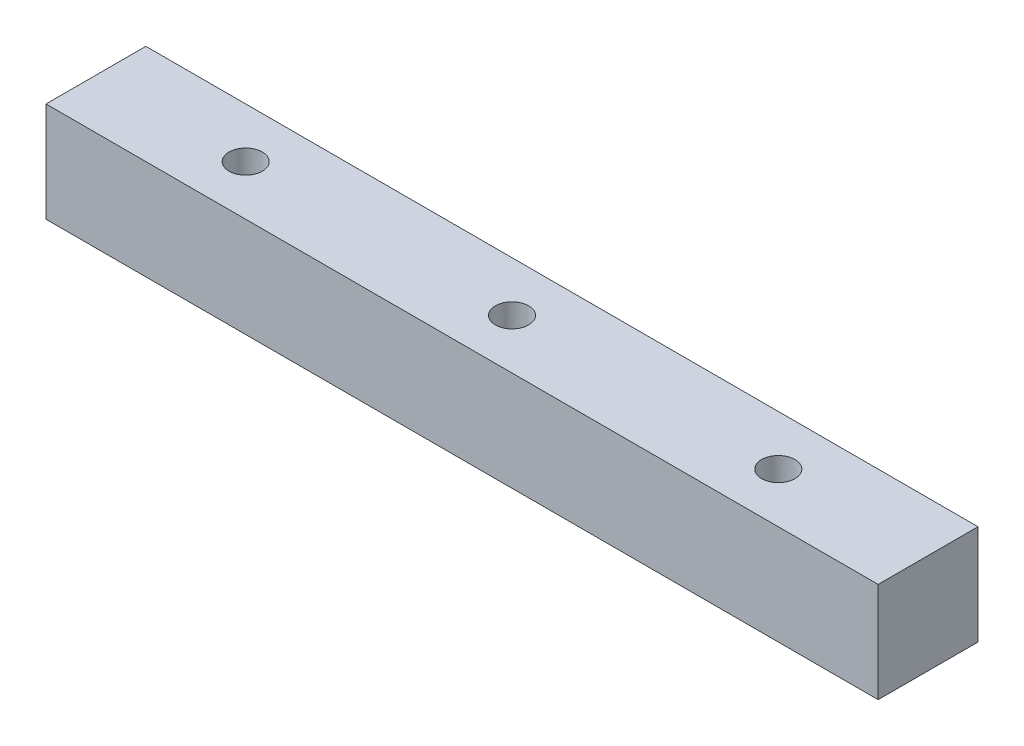
ISO-10303-21;
HEADER;
FILE_DESCRIPTION(('STEP AP214'),'2;1');
FILE_NAME('part.step','',(''),(''),'','','');
FILE_SCHEMA(('AUTOMOTIVE_DESIGN { 1 0 10303 214 1 1 1 1 }'));
ENDSEC;
DATA;
#1=APPLICATION_CONTEXT('core data for automotive mechanical design processes');
#2=APPLICATION_PROTOCOL_DEFINITION('international standard','automotive_design',2000,#1);
#3=PRODUCT_CONTEXT('',#1,'mechanical');
#4=PRODUCT('Part','Part','',(#3));
#5=PRODUCT_RELATED_PRODUCT_CATEGORY('part','',(#4));
#6=PRODUCT_DEFINITION_FORMATION('','',#4);
#7=PRODUCT_DEFINITION_CONTEXT('part definition',#1,'design');
#8=PRODUCT_DEFINITION('design','',#6,#7);
#9=PRODUCT_DEFINITION_SHAPE('','',#8);
#10=(LENGTH_UNIT() NAMED_UNIT(*) SI_UNIT(.MILLI.,.METRE.));
#11=(NAMED_UNIT(*) PLANE_ANGLE_UNIT() SI_UNIT($,.RADIAN.));
#12=(NAMED_UNIT(*) SI_UNIT($,.STERADIAN.) SOLID_ANGLE_UNIT());
#13=UNCERTAINTY_MEASURE_WITH_UNIT(LENGTH_MEASURE(1.E-05),#10,'distance_accuracy_value','');
#14=(GEOMETRIC_REPRESENTATION_CONTEXT(3) GLOBAL_UNCERTAINTY_ASSIGNED_CONTEXT((#13)) GLOBAL_UNIT_ASSIGNED_CONTEXT((#10,
#11,#12)) REPRESENTATION_CONTEXT('',''));
#15=CARTESIAN_POINT('',(0.,0.,0.));
#16=DIRECTION('',(0.,0.,1.));
#17=DIRECTION('',(1.,0.,0.));
#18=AXIS2_PLACEMENT_3D('',#15,#16,#17);
#19=CARTESIAN_POINT('',(-12.5,3.,1.5));
#20=DIRECTION('',(1.,0.,0.));
#21=DIRECTION('',(0.,0.,-1.));
#22=AXIS2_PLACEMENT_3D('',#19,#20,#21);
#23=PLANE('',#22);
#24=DIRECTION('',(0.,0.,1.));
#25=VECTOR('',#24,1.);
#26=CARTESIAN_POINT('',(-12.5,0.,1.5));
#27=LINE('',#26,#25);
#28=CARTESIAN_POINT('',(-12.5,0.,-1.5));
#29=VERTEX_POINT('',#28);
#30=CARTESIAN_POINT('',(-12.5,0.,1.5));
#31=VERTEX_POINT('',#30);
#32=EDGE_CURVE('E107',#29,#31,#27,.T.);
#33=ORIENTED_EDGE('',*,*,#32,.T.);
#34=DIRECTION('',(0.,-1.,0.));
#35=VECTOR('',#34,1.);
#36=CARTESIAN_POINT('',(-12.5,3.,1.5));
#37=LINE('',#36,#35);
#38=CARTESIAN_POINT('',(-12.5,3.,1.5));
#39=VERTEX_POINT('',#38);
#40=EDGE_CURVE('E11',#39,#31,#37,.T.);
#41=ORIENTED_EDGE('',*,*,#40,.F.);
#42=DIRECTION('',(0.,0.,1.));
#43=VECTOR('',#42,1.);
#44=CARTESIAN_POINT('',(-12.5,3.,1.5));
#45=LINE('',#44,#43);
#46=CARTESIAN_POINT('',(-12.5,3.,-1.5));
#47=VERTEX_POINT('',#46);
#48=EDGE_CURVE('E91',#47,#39,#45,.T.);
#49=ORIENTED_EDGE('',*,*,#48,.F.);
#50=DIRECTION('',(0.,-1.,0.));
#51=VECTOR('',#50,1.);
#52=CARTESIAN_POINT('',(-12.5,3.,-1.5));
#53=LINE('',#52,#51);
#54=EDGE_CURVE('E103',#47,#29,#53,.T.);
#55=ORIENTED_EDGE('',*,*,#54,.T.);
#56=EDGE_LOOP('',(#33,#41,#49,#55));
#57=FACE_BOUND('',#56,.T.);
#58=ADVANCED_FACE('F39',(#57),#23,.F.);
#59=CARTESIAN_POINT('',(12.5,3.,1.5));
#60=DIRECTION('',(0.,0.,-1.));
#61=DIRECTION('',(-1.,0.,0.));
#62=AXIS2_PLACEMENT_3D('',#59,#60,#61);
#63=PLANE('',#62);
#64=DIRECTION('',(1.,0.,0.));
#65=VECTOR('',#64,1.);
#66=CARTESIAN_POINT('',(12.5,0.,1.5));
#67=LINE('',#66,#65);
#68=CARTESIAN_POINT('',(12.5,0.,1.5));
#69=VERTEX_POINT('',#68);
#70=EDGE_CURVE('E96',#31,#69,#67,.T.);
#71=ORIENTED_EDGE('',*,*,#70,.T.);
#72=DIRECTION('',(0.,-1.,0.));
#73=VECTOR('',#72,1.);
#74=CARTESIAN_POINT('',(12.5,3.,1.5));
#75=LINE('',#74,#73);
#76=CARTESIAN_POINT('',(12.5,3.,1.5));
#77=VERTEX_POINT('',#76);
#78=EDGE_CURVE('E48',#77,#69,#75,.T.);
#79=ORIENTED_EDGE('',*,*,#78,.F.);
#80=DIRECTION('',(1.,0.,0.));
#81=VECTOR('',#80,1.);
#82=CARTESIAN_POINT('',(12.5,3.,1.5));
#83=LINE('',#82,#81);
#84=EDGE_CURVE('E86',#39,#77,#83,.T.);
#85=ORIENTED_EDGE('',*,*,#84,.F.);
#86=ORIENTED_EDGE('',*,*,#40,.T.);
#87=EDGE_LOOP('',(#71,#79,#85,#86));
#88=FACE_BOUND('',#87,.T.);
#89=ADVANCED_FACE('F95',(#88),#63,.F.);
#90=CARTESIAN_POINT('',(12.5,3.,1.5));
#91=DIRECTION('',(-1.,0.,0.));
#92=DIRECTION('',(0.,0.,1.));
#93=AXIS2_PLACEMENT_3D('',#90,#91,#92);
#94=PLANE('',#93);
#95=DIRECTION('',(0.,0.,-1.));
#96=VECTOR('',#95,1.);
#97=CARTESIAN_POINT('',(12.5,0.,1.5));
#98=LINE('',#97,#96);
#99=CARTESIAN_POINT('',(12.5,0.,-1.5));
#100=VERTEX_POINT('',#99);
#101=EDGE_CURVE('E73',#69,#100,#98,.T.);
#102=ORIENTED_EDGE('',*,*,#101,.T.);
#103=DIRECTION('',(0.,-1.,0.));
#104=VECTOR('',#103,1.);
#105=CARTESIAN_POINT('',(12.5,3.,-1.5));
#106=LINE('',#105,#104);
#107=CARTESIAN_POINT('',(12.5,3.,-1.5));
#108=VERTEX_POINT('',#107);
#109=EDGE_CURVE('E98',#108,#100,#106,.T.);
#110=ORIENTED_EDGE('',*,*,#109,.F.);
#111=DIRECTION('',(0.,0.,-1.));
#112=VECTOR('',#111,1.);
#113=CARTESIAN_POINT('',(12.5,3.,1.5));
#114=LINE('',#113,#112);
#115=EDGE_CURVE('E89',#77,#108,#114,.T.);
#116=ORIENTED_EDGE('',*,*,#115,.F.);
#117=ORIENTED_EDGE('',*,*,#78,.T.);
#118=EDGE_LOOP('',(#102,#110,#116,#117));
#119=FACE_BOUND('',#118,.T.);
#120=ADVANCED_FACE('F99',(#119),#94,.F.);
#121=CARTESIAN_POINT('',(12.5,3.,-1.5));
#122=DIRECTION('',(0.,0.,1.));
#123=DIRECTION('',(1.,0.,0.));
#124=AXIS2_PLACEMENT_3D('',#121,#122,#123);
#125=PLANE('',#124);
#126=DIRECTION('',(-1.,0.,0.));
#127=VECTOR('',#126,1.);
#128=CARTESIAN_POINT('',(12.5,0.,-1.5));
#129=LINE('',#128,#127);
#130=EDGE_CURVE('E79',#100,#29,#129,.T.);
#131=ORIENTED_EDGE('',*,*,#130,.T.);
#132=ORIENTED_EDGE('',*,*,#54,.F.);
#133=DIRECTION('',(-1.,0.,0.));
#134=VECTOR('',#133,1.);
#135=CARTESIAN_POINT('',(12.5,3.,-1.5));
#136=LINE('',#135,#134);
#137=EDGE_CURVE('E56',#108,#47,#136,.T.);
#138=ORIENTED_EDGE('',*,*,#137,.F.);
#139=ORIENTED_EDGE('',*,*,#109,.T.);
#140=EDGE_LOOP('',(#131,#132,#138,#139));
#141=FACE_BOUND('',#140,.T.);
#142=ADVANCED_FACE('F121',(#141),#125,.F.);
#143=CARTESIAN_POINT('',(0.,3.,0.));
#144=DIRECTION('',(0.,1.,0.));
#145=DIRECTION('',(0.,0.,1.));
#146=AXIS2_PLACEMENT_3D('',#143,#144,#145);
#147=PLANE('',#146);
#148=CARTESIAN_POINT('',(-8.,3.,0.));
#149=DIRECTION('',(0.,1.,0.));
#150=DIRECTION('',(0.,0.,1.));
#151=AXIS2_PLACEMENT_3D('',#148,#149,#150);
#152=CIRCLE('',#151,0.500000000000001);
#153=CARTESIAN_POINT('',(-8.,3.,0.500000000000001));
#154=VERTEX_POINT('',#153);
#155=EDGE_CURVE('E144',#154,#154,#152,.T.);
#156=ORIENTED_EDGE('',*,*,#155,.F.);
#157=EDGE_LOOP('',(#156));
#158=FACE_BOUND('',#157,.T.);
#159=CARTESIAN_POINT('',(0.,3.,0.));
#160=DIRECTION('',(0.,1.,0.));
#161=DIRECTION('',(0.,0.,1.));
#162=AXIS2_PLACEMENT_3D('',#159,#160,#161);
#163=CIRCLE('',#162,0.5);
#164=CARTESIAN_POINT('',(0.,3.,0.5));
#165=VERTEX_POINT('',#164);
#166=EDGE_CURVE('E136',#165,#165,#163,.T.);
#167=ORIENTED_EDGE('',*,*,#166,.F.);
#168=EDGE_LOOP('',(#167));
#169=FACE_BOUND('',#168,.T.);
#170=CARTESIAN_POINT('',(8.,3.,0.));
#171=DIRECTION('',(0.,1.,0.));
#172=DIRECTION('',(0.,0.,-1.));
#173=AXIS2_PLACEMENT_3D('',#170,#171,#172);
#174=CIRCLE('',#173,0.500000000000001);
#175=CARTESIAN_POINT('',(8.,3.,-0.500000000000001));
#176=VERTEX_POINT('',#175);
#177=EDGE_CURVE('E128',#176,#176,#174,.T.);
#178=ORIENTED_EDGE('',*,*,#177,.F.);
#179=EDGE_LOOP('',(#178));
#180=FACE_BOUND('',#179,.T.);
#181=ORIENTED_EDGE('',*,*,#48,.T.);
#182=ORIENTED_EDGE('',*,*,#84,.T.);
#183=ORIENTED_EDGE('',*,*,#115,.T.);
#184=ORIENTED_EDGE('',*,*,#137,.T.);
#185=EDGE_LOOP('',(#181,#182,#183,#184));
#186=FACE_BOUND('',#185,.T.);
#187=ADVANCED_FACE('F87',(#158,#169,#180,#186),#147,.T.);
#188=CARTESIAN_POINT('',(0.,0.,0.));
#189=DIRECTION('',(0.,1.,0.));
#190=DIRECTION('',(0.,0.,1.));
#191=AXIS2_PLACEMENT_3D('',#188,#189,#190);
#192=PLANE('',#191);
#193=CARTESIAN_POINT('',(-8.,0.,0.));
#194=DIRECTION('',(0.,1.,0.));
#195=DIRECTION('',(0.,0.,1.));
#196=AXIS2_PLACEMENT_3D('',#193,#194,#195);
#197=CIRCLE('',#196,0.500000000000001);
#198=CARTESIAN_POINT('',(-8.,0.,0.500000000000001));
#199=VERTEX_POINT('',#198);
#200=EDGE_CURVE('E111',#199,#199,#197,.T.);
#201=ORIENTED_EDGE('',*,*,#200,.T.);
#202=EDGE_LOOP('',(#201));
#203=FACE_BOUND('',#202,.T.);
#204=CARTESIAN_POINT('',(0.,0.,0.));
#205=DIRECTION('',(0.,1.,0.));
#206=DIRECTION('',(0.,0.,1.));
#207=AXIS2_PLACEMENT_3D('',#204,#205,#206);
#208=CIRCLE('',#207,0.5);
#209=CARTESIAN_POINT('',(0.,0.,0.5));
#210=VERTEX_POINT('',#209);
#211=EDGE_CURVE('E140',#210,#210,#208,.T.);
#212=ORIENTED_EDGE('',*,*,#211,.T.);
#213=EDGE_LOOP('',(#212));
#214=FACE_BOUND('',#213,.T.);
#215=CARTESIAN_POINT('',(8.,0.,0.));
#216=DIRECTION('',(0.,1.,0.));
#217=DIRECTION('',(0.,0.,-1.));
#218=AXIS2_PLACEMENT_3D('',#215,#216,#217);
#219=CIRCLE('',#218,0.500000000000001);
#220=CARTESIAN_POINT('',(8.,0.,-0.500000000000001));
#221=VERTEX_POINT('',#220);
#222=EDGE_CURVE('E132',#221,#221,#219,.T.);
#223=ORIENTED_EDGE('',*,*,#222,.T.);
#224=EDGE_LOOP('',(#223));
#225=FACE_BOUND('',#224,.T.);
#226=ORIENTED_EDGE('',*,*,#32,.F.);
#227=ORIENTED_EDGE('',*,*,#130,.F.);
#228=ORIENTED_EDGE('',*,*,#101,.F.);
#229=ORIENTED_EDGE('',*,*,#70,.F.);
#230=EDGE_LOOP('',(#226,#227,#228,#229));
#231=FACE_BOUND('',#230,.T.);
#232=ADVANCED_FACE('F124',(#203,#214,#225,#231),#192,.F.);
#233=CARTESIAN_POINT('',(8.,0.,0.));
#234=DIRECTION('',(0.,1.,0.));
#235=DIRECTION('',(0.,0.,1.));
#236=AXIS2_PLACEMENT_3D('',#233,#234,#235);
#237=CYLINDRICAL_SURFACE('',#236,0.500000000000001);
#238=ORIENTED_EDGE('',*,*,#222,.F.);
#239=EDGE_LOOP('',(#238));
#240=FACE_BOUND('',#239,.T.);
#241=ORIENTED_EDGE('',*,*,#177,.T.);
#242=EDGE_LOOP('',(#241));
#243=FACE_BOUND('',#242,.T.);
#244=ADVANCED_FACE('F168',(#240,#243),#237,.F.);
#245=CARTESIAN_POINT('',(0.,0.,0.));
#246=DIRECTION('',(0.,1.,0.));
#247=DIRECTION('',(0.,0.,1.));
#248=AXIS2_PLACEMENT_3D('',#245,#246,#247);
#249=CYLINDRICAL_SURFACE('',#248,0.5);
#250=ORIENTED_EDGE('',*,*,#211,.F.);
#251=EDGE_LOOP('',(#250));
#252=FACE_BOUND('',#251,.T.);
#253=ORIENTED_EDGE('',*,*,#166,.T.);
#254=EDGE_LOOP('',(#253));
#255=FACE_BOUND('',#254,.T.);
#256=ADVANCED_FACE('F157',(#252,#255),#249,.F.);
#257=CARTESIAN_POINT('',(-8.,0.,0.));
#258=DIRECTION('',(0.,1.,0.));
#259=DIRECTION('',(0.,0.,1.));
#260=AXIS2_PLACEMENT_3D('',#257,#258,#259);
#261=CYLINDRICAL_SURFACE('',#260,0.500000000000001);
#262=ORIENTED_EDGE('',*,*,#200,.F.);
#263=EDGE_LOOP('',(#262));
#264=FACE_BOUND('',#263,.T.);
#265=ORIENTED_EDGE('',*,*,#155,.T.);
#266=EDGE_LOOP('',(#265));
#267=FACE_BOUND('',#266,.T.);
#268=ADVANCED_FACE('F154',(#264,#267),#261,.F.);
#269=CLOSED_SHELL('',(#58,#89,#120,#142,#187,#232,#244,#256,#268));
#270=MANIFOLD_SOLID_BREP('B2',#269);
#271=ADVANCED_BREP_SHAPE_REPRESENTATION('',(#18,#270),#14);
#272=SHAPE_DEFINITION_REPRESENTATION(#9,#271);
ENDSEC;
END-ISO-10303-21;
